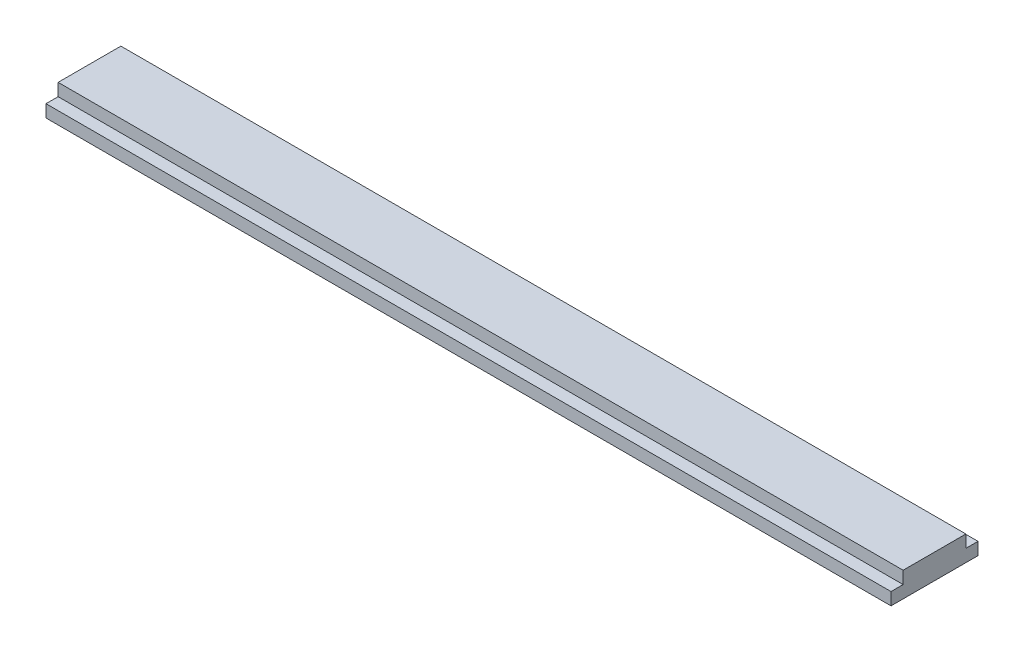
ISO-10303-21;
HEADER;
FILE_DESCRIPTION(('STEP AP214'),'2;1');
FILE_NAME('part.step','',(''),(''),'','','');
FILE_SCHEMA(('AUTOMOTIVE_DESIGN { 1 0 10303 214 1 1 1 1 }'));
ENDSEC;
DATA;
#1=APPLICATION_CONTEXT('core data for automotive mechanical design processes');
#2=APPLICATION_PROTOCOL_DEFINITION('international standard','automotive_design',2000,#1);
#3=PRODUCT_CONTEXT('',#1,'mechanical');
#4=PRODUCT('Part','Part','',(#3));
#5=PRODUCT_RELATED_PRODUCT_CATEGORY('part','',(#4));
#6=PRODUCT_DEFINITION_FORMATION('','',#4);
#7=PRODUCT_DEFINITION_CONTEXT('part definition',#1,'design');
#8=PRODUCT_DEFINITION('design','',#6,#7);
#9=PRODUCT_DEFINITION_SHAPE('','',#8);
#10=(LENGTH_UNIT() NAMED_UNIT(*) SI_UNIT(.MILLI.,.METRE.));
#11=(NAMED_UNIT(*) PLANE_ANGLE_UNIT() SI_UNIT($,.RADIAN.));
#12=(NAMED_UNIT(*) SI_UNIT($,.STERADIAN.) SOLID_ANGLE_UNIT());
#13=UNCERTAINTY_MEASURE_WITH_UNIT(LENGTH_MEASURE(1.E-05),#10,'distance_accuracy_value','');
#14=(GEOMETRIC_REPRESENTATION_CONTEXT(3) GLOBAL_UNCERTAINTY_ASSIGNED_CONTEXT((#13)) GLOBAL_UNIT_ASSIGNED_CONTEXT((#10,
#11,#12)) REPRESENTATION_CONTEXT('',''));
#15=CARTESIAN_POINT('',(0.,0.,0.));
#16=DIRECTION('',(0.,0.,1.));
#17=DIRECTION('',(1.,0.,0.));
#18=AXIS2_PLACEMENT_3D('',#15,#16,#17);
#19=CARTESIAN_POINT('',(-68.,4.,0.));
#20=DIRECTION('',(1.,0.,0.));
#21=DIRECTION('',(0.,0.,-1.));
#22=AXIS2_PLACEMENT_3D('',#19,#20,#21);
#23=PLANE('',#22);
#24=DIRECTION('',(0.,0.,1.));
#25=VECTOR('',#24,1.);
#26=CARTESIAN_POINT('',(-68.,0.,0.));
#27=LINE('',#26,#25);
#28=CARTESIAN_POINT('',(-68.,0.,-7.));
#29=VERTEX_POINT('',#28);
#30=CARTESIAN_POINT('',(-68.,0.,7.));
#31=VERTEX_POINT('',#30);
#32=EDGE_CURVE('E137',#29,#31,#27,.T.);
#33=ORIENTED_EDGE('',*,*,#32,.T.);
#34=DIRECTION('',(0.,-1.,0.));
#35=VECTOR('',#34,1.);
#36=CARTESIAN_POINT('',(-68.,2.,7.));
#37=LINE('',#36,#35);
#38=CARTESIAN_POINT('',(-68.,2.,7.));
#39=VERTEX_POINT('',#38);
#40=EDGE_CURVE('E111',#39,#31,#37,.T.);
#41=ORIENTED_EDGE('',*,*,#40,.F.);
#42=DIRECTION('',(0.,0.,1.));
#43=VECTOR('',#42,1.);
#44=CARTESIAN_POINT('',(-68.,2.,0.));
#45=LINE('',#44,#43);
#46=CARTESIAN_POINT('',(-68.,2.,5.05));
#47=VERTEX_POINT('',#46);
#48=EDGE_CURVE('E108',#47,#39,#45,.T.);
#49=ORIENTED_EDGE('',*,*,#48,.F.);
#50=DIRECTION('',(0.,-1.,0.));
#51=VECTOR('',#50,1.);
#52=CARTESIAN_POINT('',(-68.,4.,5.05));
#53=LINE('',#52,#51);
#54=CARTESIAN_POINT('',(-68.,4.,5.05));
#55=VERTEX_POINT('',#54);
#56=EDGE_CURVE('E11',#55,#47,#53,.T.);
#57=ORIENTED_EDGE('',*,*,#56,.F.);
#58=DIRECTION('',(0.,0.,1.));
#59=VECTOR('',#58,1.);
#60=CARTESIAN_POINT('',(-68.,4.,0.));
#61=LINE('',#60,#59);
#62=CARTESIAN_POINT('',(-68.,4.,-5.05));
#63=VERTEX_POINT('',#62);
#64=EDGE_CURVE('E129',#63,#55,#61,.T.);
#65=ORIENTED_EDGE('',*,*,#64,.F.);
#66=DIRECTION('',(0.,-1.,0.));
#67=VECTOR('',#66,1.);
#68=CARTESIAN_POINT('',(-68.,4.,-5.05));
#69=LINE('',#68,#67);
#70=CARTESIAN_POINT('',(-68.,2.,-5.05));
#71=VERTEX_POINT('',#70);
#72=EDGE_CURVE('E145',#63,#71,#69,.T.);
#73=ORIENTED_EDGE('',*,*,#72,.T.);
#74=DIRECTION('',(0.,0.,1.));
#75=VECTOR('',#74,1.);
#76=CARTESIAN_POINT('',(-68.,2.,0.));
#77=LINE('',#76,#75);
#78=CARTESIAN_POINT('',(-68.,2.,-7.));
#79=VERTEX_POINT('',#78);
#80=EDGE_CURVE('E157',#79,#71,#77,.T.);
#81=ORIENTED_EDGE('',*,*,#80,.F.);
#82=DIRECTION('',(0.,-1.,0.));
#83=VECTOR('',#82,1.);
#84=CARTESIAN_POINT('',(-68.,2.,-7.));
#85=LINE('',#84,#83);
#86=EDGE_CURVE('E174',#79,#29,#85,.T.);
#87=ORIENTED_EDGE('',*,*,#86,.T.);
#88=EDGE_LOOP('',(#33,#41,#49,#57,#65,#73,#81,#87));
#89=FACE_BOUND('',#88,.T.);
#90=ADVANCED_FACE('F43',(#89),#23,.F.);
#91=CARTESIAN_POINT('',(0.,4.,5.05));
#92=DIRECTION('',(0.,0.,-1.));
#93=DIRECTION('',(-1.,0.,0.));
#94=AXIS2_PLACEMENT_3D('',#91,#92,#93);
#95=PLANE('',#94);
#96=ORIENTED_EDGE('',*,*,#56,.T.);
#97=DIRECTION('',(1.,0.,0.));
#98=VECTOR('',#97,1.);
#99=CARTESIAN_POINT('',(0.,2.,5.05));
#100=LINE('',#99,#98);
#101=CARTESIAN_POINT('',(68.,2.,5.05));
#102=VERTEX_POINT('',#101);
#103=EDGE_CURVE('E114',#47,#102,#100,.T.);
#104=ORIENTED_EDGE('',*,*,#103,.T.);
#105=DIRECTION('',(0.,-1.,0.));
#106=VECTOR('',#105,1.);
#107=CARTESIAN_POINT('',(68.,4.,5.05));
#108=LINE('',#107,#106);
#109=CARTESIAN_POINT('',(68.,4.,5.05));
#110=VERTEX_POINT('',#109);
#111=EDGE_CURVE('E50',#110,#102,#108,.T.);
#112=ORIENTED_EDGE('',*,*,#111,.F.);
#113=DIRECTION('',(1.,0.,0.));
#114=VECTOR('',#113,1.);
#115=CARTESIAN_POINT('',(0.,4.,5.05));
#116=LINE('',#115,#114);
#117=EDGE_CURVE('E123',#55,#110,#116,.T.);
#118=ORIENTED_EDGE('',*,*,#117,.F.);
#119=EDGE_LOOP('',(#96,#104,#112,#118));
#120=FACE_BOUND('',#119,.T.);
#121=ADVANCED_FACE('F122',(#120),#95,.F.);
#122=CARTESIAN_POINT('',(68.,4.,0.));
#123=DIRECTION('',(1.,0.,0.));
#124=DIRECTION('',(0.,0.,-1.));
#125=AXIS2_PLACEMENT_3D('',#122,#123,#124);
#126=PLANE('',#125);
#127=DIRECTION('',(0.,0.,1.));
#128=VECTOR('',#127,1.);
#129=CARTESIAN_POINT('',(68.,0.,0.));
#130=LINE('',#129,#128);
#131=CARTESIAN_POINT('',(68.,0.,-7.));
#132=VERTEX_POINT('',#131);
#133=CARTESIAN_POINT('',(68.,0.,7.));
#134=VERTEX_POINT('',#133);
#135=EDGE_CURVE('E135',#132,#134,#130,.T.);
#136=ORIENTED_EDGE('',*,*,#135,.F.);
#137=DIRECTION('',(0.,-1.,0.));
#138=VECTOR('',#137,1.);
#139=CARTESIAN_POINT('',(68.,2.,-7.));
#140=LINE('',#139,#138);
#141=CARTESIAN_POINT('',(68.,2.,-7.));
#142=VERTEX_POINT('',#141);
#143=EDGE_CURVE('E140',#142,#132,#140,.T.);
#144=ORIENTED_EDGE('',*,*,#143,.F.);
#145=DIRECTION('',(0.,0.,1.));
#146=VECTOR('',#145,1.);
#147=CARTESIAN_POINT('',(68.,2.,0.));
#148=LINE('',#147,#146);
#149=CARTESIAN_POINT('',(68.,2.,-5.05));
#150=VERTEX_POINT('',#149);
#151=EDGE_CURVE('E166',#142,#150,#148,.T.);
#152=ORIENTED_EDGE('',*,*,#151,.T.);
#153=DIRECTION('',(0.,-1.,0.));
#154=VECTOR('',#153,1.);
#155=CARTESIAN_POINT('',(68.,4.,-5.05));
#156=LINE('',#155,#154);
#157=CARTESIAN_POINT('',(68.,4.,-5.05));
#158=VERTEX_POINT('',#157);
#159=EDGE_CURVE('E148',#158,#150,#156,.T.);
#160=ORIENTED_EDGE('',*,*,#159,.F.);
#161=DIRECTION('',(0.,0.,1.));
#162=VECTOR('',#161,1.);
#163=CARTESIAN_POINT('',(68.,4.,0.));
#164=LINE('',#163,#162);
#165=EDGE_CURVE('E128',#158,#110,#164,.T.);
#166=ORIENTED_EDGE('',*,*,#165,.T.);
#167=ORIENTED_EDGE('',*,*,#111,.T.);
#168=DIRECTION('',(0.,0.,1.));
#169=VECTOR('',#168,1.);
#170=CARTESIAN_POINT('',(68.,2.,0.));
#171=LINE('',#170,#169);
#172=CARTESIAN_POINT('',(68.,2.,7.));
#173=VERTEX_POINT('',#172);
#174=EDGE_CURVE('E57',#102,#173,#171,.T.);
#175=ORIENTED_EDGE('',*,*,#174,.T.);
#176=DIRECTION('',(0.,-1.,0.));
#177=VECTOR('',#176,1.);
#178=CARTESIAN_POINT('',(68.,2.,7.));
#179=LINE('',#178,#177);
#180=EDGE_CURVE('E185',#173,#134,#179,.T.);
#181=ORIENTED_EDGE('',*,*,#180,.T.);
#182=EDGE_LOOP('',(#136,#144,#152,#160,#166,#167,#175,#181));
#183=FACE_BOUND('',#182,.T.);
#184=ADVANCED_FACE('F150',(#183),#126,.T.);
#185=CARTESIAN_POINT('',(0.,4.,-5.05));
#186=DIRECTION('',(0.,0.,-1.));
#187=DIRECTION('',(-1.,0.,0.));
#188=AXIS2_PLACEMENT_3D('',#185,#186,#187);
#189=PLANE('',#188);
#190=DIRECTION('',(1.,0.,0.));
#191=VECTOR('',#190,1.);
#192=CARTESIAN_POINT('',(0.,2.,-5.05));
#193=LINE('',#192,#191);
#194=EDGE_CURVE('E65',#71,#150,#193,.T.);
#195=ORIENTED_EDGE('',*,*,#194,.F.);
#196=ORIENTED_EDGE('',*,*,#72,.F.);
#197=DIRECTION('',(1.,0.,0.));
#198=VECTOR('',#197,1.);
#199=CARTESIAN_POINT('',(0.,4.,-5.05));
#200=LINE('',#199,#198);
#201=EDGE_CURVE('E134',#63,#158,#200,.T.);
#202=ORIENTED_EDGE('',*,*,#201,.T.);
#203=ORIENTED_EDGE('',*,*,#159,.T.);
#204=EDGE_LOOP('',(#195,#196,#202,#203));
#205=FACE_BOUND('',#204,.T.);
#206=ADVANCED_FACE('F153',(#205),#189,.T.);
#207=CARTESIAN_POINT('',(0.,4.,0.));
#208=DIRECTION('',(0.,1.,0.));
#209=DIRECTION('',(0.,0.,1.));
#210=AXIS2_PLACEMENT_3D('',#207,#208,#209);
#211=PLANE('',#210);
#212=ORIENTED_EDGE('',*,*,#64,.T.);
#213=ORIENTED_EDGE('',*,*,#117,.T.);
#214=ORIENTED_EDGE('',*,*,#165,.F.);
#215=ORIENTED_EDGE('',*,*,#201,.F.);
#216=EDGE_LOOP('',(#212,#213,#214,#215));
#217=FACE_BOUND('',#216,.T.);
#218=ADVANCED_FACE('F132',(#217),#211,.T.);
#219=CARTESIAN_POINT('',(0.,0.,0.));
#220=DIRECTION('',(0.,1.,0.));
#221=DIRECTION('',(0.,0.,1.));
#222=AXIS2_PLACEMENT_3D('',#219,#220,#221);
#223=PLANE('',#222);
#224=ORIENTED_EDGE('',*,*,#32,.F.);
#225=DIRECTION('',(1.,0.,0.));
#226=VECTOR('',#225,1.);
#227=CARTESIAN_POINT('',(0.,0.,-7.));
#228=LINE('',#227,#226);
#229=EDGE_CURVE('E164',#29,#132,#228,.T.);
#230=ORIENTED_EDGE('',*,*,#229,.T.);
#231=ORIENTED_EDGE('',*,*,#135,.T.);
#232=DIRECTION('',(1.,0.,0.));
#233=VECTOR('',#232,1.);
#234=CARTESIAN_POINT('',(0.,0.,7.));
#235=LINE('',#234,#233);
#236=EDGE_CURVE('E120',#31,#134,#235,.T.);
#237=ORIENTED_EDGE('',*,*,#236,.F.);
#238=EDGE_LOOP('',(#224,#230,#231,#237));
#239=FACE_BOUND('',#238,.T.);
#240=ADVANCED_FACE('F208',(#239),#223,.F.);
#241=CARTESIAN_POINT('',(0.,2.,-7.));
#242=DIRECTION('',(0.,0.,-1.));
#243=DIRECTION('',(-1.,0.,0.));
#244=AXIS2_PLACEMENT_3D('',#241,#242,#243);
#245=PLANE('',#244);
#246=ORIENTED_EDGE('',*,*,#229,.F.);
#247=ORIENTED_EDGE('',*,*,#86,.F.);
#248=DIRECTION('',(1.,0.,0.));
#249=VECTOR('',#248,1.);
#250=CARTESIAN_POINT('',(0.,2.,-7.));
#251=LINE('',#250,#249);
#252=EDGE_CURVE('E163',#79,#142,#251,.T.);
#253=ORIENTED_EDGE('',*,*,#252,.T.);
#254=ORIENTED_EDGE('',*,*,#143,.T.);
#255=EDGE_LOOP('',(#246,#247,#253,#254));
#256=FACE_BOUND('',#255,.T.);
#257=ADVANCED_FACE('F194',(#256),#245,.T.);
#258=CARTESIAN_POINT('',(0.,2.,0.));
#259=DIRECTION('',(0.,1.,0.));
#260=DIRECTION('',(0.,0.,1.));
#261=AXIS2_PLACEMENT_3D('',#258,#259,#260);
#262=PLANE('',#261);
#263=ORIENTED_EDGE('',*,*,#80,.T.);
#264=ORIENTED_EDGE('',*,*,#194,.T.);
#265=ORIENTED_EDGE('',*,*,#151,.F.);
#266=ORIENTED_EDGE('',*,*,#252,.F.);
#267=EDGE_LOOP('',(#263,#264,#265,#266));
#268=FACE_BOUND('',#267,.T.);
#269=ADVANCED_FACE('F160',(#268),#262,.T.);
#270=CARTESIAN_POINT('',(0.,2.,7.));
#271=DIRECTION('',(0.,0.,-1.));
#272=DIRECTION('',(-1.,0.,0.));
#273=AXIS2_PLACEMENT_3D('',#270,#271,#272);
#274=PLANE('',#273);
#275=ORIENTED_EDGE('',*,*,#236,.T.);
#276=ORIENTED_EDGE('',*,*,#180,.F.);
#277=DIRECTION('',(1.,0.,0.));
#278=VECTOR('',#277,1.);
#279=CARTESIAN_POINT('',(0.,2.,7.));
#280=LINE('',#279,#278);
#281=EDGE_CURVE('E113',#39,#173,#280,.T.);
#282=ORIENTED_EDGE('',*,*,#281,.F.);
#283=ORIENTED_EDGE('',*,*,#40,.T.);
#284=EDGE_LOOP('',(#275,#276,#282,#283));
#285=FACE_BOUND('',#284,.T.);
#286=ADVANCED_FACE('F186',(#285),#274,.F.);
#287=CARTESIAN_POINT('',(0.,2.,0.));
#288=DIRECTION('',(0.,1.,0.));
#289=DIRECTION('',(0.,0.,1.));
#290=AXIS2_PLACEMENT_3D('',#287,#288,#289);
#291=PLANE('',#290);
#292=ORIENTED_EDGE('',*,*,#103,.F.);
#293=ORIENTED_EDGE('',*,*,#48,.T.);
#294=ORIENTED_EDGE('',*,*,#281,.T.);
#295=ORIENTED_EDGE('',*,*,#174,.F.);
#296=EDGE_LOOP('',(#292,#293,#294,#295));
#297=FACE_BOUND('',#296,.T.);
#298=ADVANCED_FACE('F116',(#297),#291,.T.);
#299=CLOSED_SHELL('',(#90,#121,#184,#206,#218,#240,#257,#269,#286,#298));
#300=MANIFOLD_SOLID_BREP('B2',#299);
#301=ADVANCED_BREP_SHAPE_REPRESENTATION('',(#18,#300),#14);
#302=SHAPE_DEFINITION_REPRESENTATION(#9,#301);
ENDSEC;
END-ISO-10303-21;
